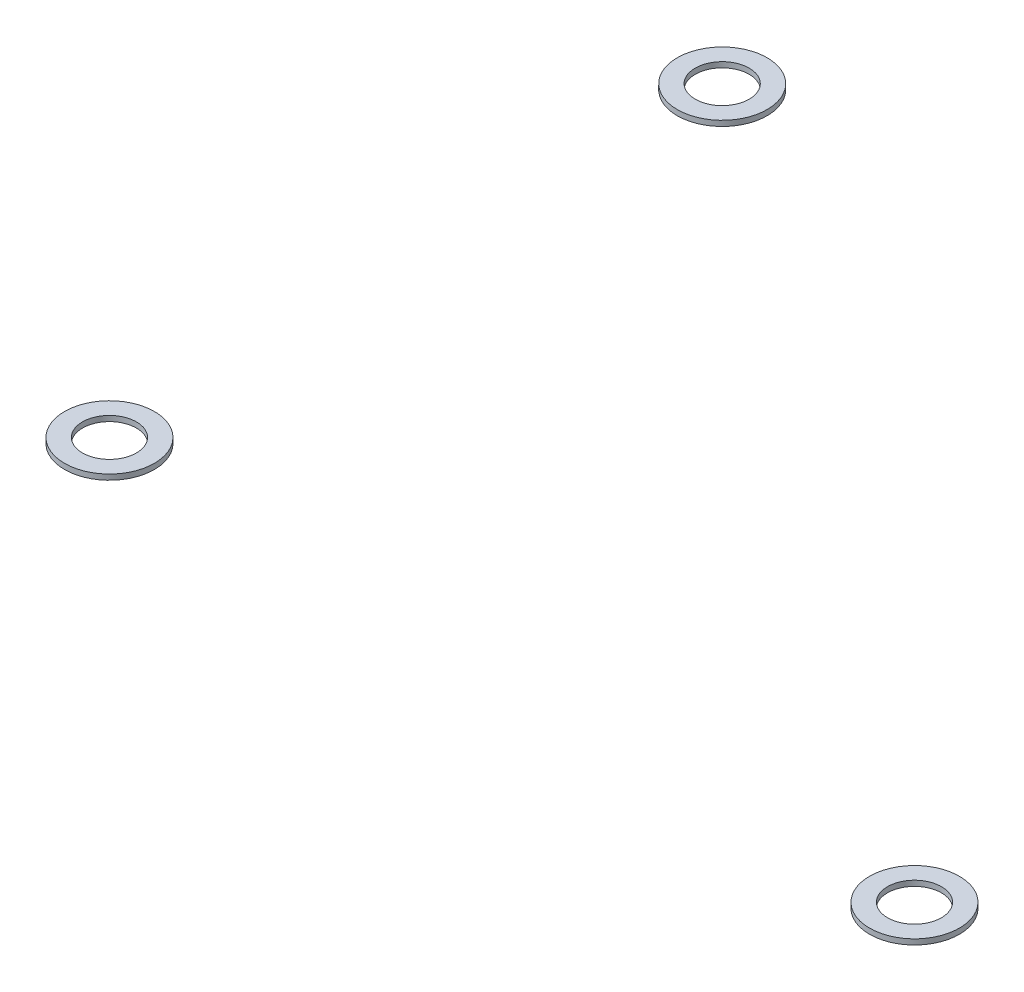
ISO-10303-21;
HEADER;
FILE_DESCRIPTION(('STEP AP214'),'2;1');
FILE_NAME('part.step','',(''),(''),'','','');
FILE_SCHEMA(('AUTOMOTIVE_DESIGN { 1 0 10303 214 1 1 1 1 }'));
ENDSEC;
DATA;
#1=APPLICATION_CONTEXT('core data for automotive mechanical design processes');
#2=APPLICATION_PROTOCOL_DEFINITION('international standard','automotive_design',2000,#1);
#3=PRODUCT_CONTEXT('',#1,'mechanical');
#4=PRODUCT('Part','Part','',(#3));
#5=PRODUCT_RELATED_PRODUCT_CATEGORY('part','',(#4));
#6=PRODUCT_DEFINITION_FORMATION('','',#4);
#7=PRODUCT_DEFINITION_CONTEXT('part definition',#1,'design');
#8=PRODUCT_DEFINITION('design','',#6,#7);
#9=PRODUCT_DEFINITION_SHAPE('','',#8);
#10=(LENGTH_UNIT() NAMED_UNIT(*) SI_UNIT(.MILLI.,.METRE.));
#11=(NAMED_UNIT(*) PLANE_ANGLE_UNIT() SI_UNIT($,.RADIAN.));
#12=(NAMED_UNIT(*) SI_UNIT($,.STERADIAN.) SOLID_ANGLE_UNIT());
#13=UNCERTAINTY_MEASURE_WITH_UNIT(LENGTH_MEASURE(1.E-05),#10,'distance_accuracy_value','');
#14=(GEOMETRIC_REPRESENTATION_CONTEXT(3) GLOBAL_UNCERTAINTY_ASSIGNED_CONTEXT((#13)) GLOBAL_UNIT_ASSIGNED_CONTEXT((#10,
#11,#12)) REPRESENTATION_CONTEXT('',''));
#15=CARTESIAN_POINT('',(0.,0.,0.));
#16=DIRECTION('',(0.,0.,1.));
#17=DIRECTION('',(1.,0.,0.));
#18=AXIS2_PLACEMENT_3D('',#15,#16,#17);
#19=CARTESIAN_POINT('',(22.4,0.3,17.05));
#20=DIRECTION('',(0.,1.,0.));
#21=DIRECTION('',(0.,0.,1.));
#22=AXIS2_PLACEMENT_3D('',#19,#20,#21);
#23=PLANE('',#22);
#24=CARTESIAN_POINT('',(22.4,0.3,17.05));
#25=DIRECTION('',(0.,1.,0.));
#26=DIRECTION('',(0.,0.,1.));
#27=AXIS2_PLACEMENT_3D('',#24,#25,#26);
#28=CIRCLE('',#27,2.5);
#29=CARTESIAN_POINT('',(22.4,0.3,19.55));
#30=VERTEX_POINT('',#29);
#31=EDGE_CURVE('E67',#30,#30,#28,.T.);
#32=ORIENTED_EDGE('',*,*,#31,.T.);
#33=EDGE_LOOP('',(#32));
#34=FACE_BOUND('',#33,.T.);
#35=CARTESIAN_POINT('',(22.4,0.3,17.05));
#36=DIRECTION('',(0.,1.,0.));
#37=DIRECTION('',(0.,0.,1.));
#38=AXIS2_PLACEMENT_3D('',#35,#36,#37);
#39=CIRCLE('',#38,1.5);
#40=CARTESIAN_POINT('',(22.4,0.3,18.55));
#41=VERTEX_POINT('',#40);
#42=EDGE_CURVE('E56',#41,#41,#39,.T.);
#43=ORIENTED_EDGE('',*,*,#42,.F.);
#44=EDGE_LOOP('',(#43));
#45=FACE_BOUND('',#44,.T.);
#46=ADVANCED_FACE('F52',(#34,#45),#23,.T.);
#47=CARTESIAN_POINT('',(22.4,0.,17.05));
#48=DIRECTION('',(0.,1.,0.));
#49=DIRECTION('',(0.,0.,1.));
#50=AXIS2_PLACEMENT_3D('',#47,#48,#49);
#51=PLANE('',#50);
#52=CARTESIAN_POINT('',(22.4,0.,17.05));
#53=DIRECTION('',(0.,1.,0.));
#54=DIRECTION('',(0.,0.,1.));
#55=AXIS2_PLACEMENT_3D('',#52,#53,#54);
#56=CIRCLE('',#55,2.5);
#57=CARTESIAN_POINT('',(22.4,0.,19.55));
#58=VERTEX_POINT('',#57);
#59=EDGE_CURVE('E65',#58,#58,#56,.T.);
#60=ORIENTED_EDGE('',*,*,#59,.F.);
#61=EDGE_LOOP('',(#60));
#62=FACE_BOUND('',#61,.T.);
#63=CARTESIAN_POINT('',(22.4,0.,17.05));
#64=DIRECTION('',(0.,1.,0.));
#65=DIRECTION('',(0.,0.,1.));
#66=AXIS2_PLACEMENT_3D('',#63,#64,#65);
#67=CIRCLE('',#66,1.5);
#68=CARTESIAN_POINT('',(22.4,0.,18.55));
#69=VERTEX_POINT('',#68);
#70=EDGE_CURVE('E11',#69,#69,#67,.T.);
#71=ORIENTED_EDGE('',*,*,#70,.T.);
#72=EDGE_LOOP('',(#71));
#73=FACE_BOUND('',#72,.T.);
#74=ADVANCED_FACE('F77',(#62,#73),#51,.F.);
#75=CARTESIAN_POINT('',(22.4,0.3,17.05));
#76=DIRECTION('',(0.,-1.,0.));
#77=DIRECTION('',(0.,0.,-1.));
#78=AXIS2_PLACEMENT_3D('',#75,#76,#77);
#79=CYLINDRICAL_SURFACE('',#78,2.5);
#80=ORIENTED_EDGE('',*,*,#31,.F.);
#81=EDGE_LOOP('',(#80));
#82=FACE_BOUND('',#81,.T.);
#83=ORIENTED_EDGE('',*,*,#59,.T.);
#84=EDGE_LOOP('',(#83));
#85=FACE_BOUND('',#84,.T.);
#86=ADVANCED_FACE('F75',(#82,#85),#79,.T.);
#87=CARTESIAN_POINT('',(22.4,0.3,17.05));
#88=DIRECTION('',(0.,-1.,0.));
#89=DIRECTION('',(0.,0.,-1.));
#90=AXIS2_PLACEMENT_3D('',#87,#88,#89);
#91=CYLINDRICAL_SURFACE('',#90,1.5);
#92=ORIENTED_EDGE('',*,*,#42,.T.);
#93=EDGE_LOOP('',(#92));
#94=FACE_BOUND('',#93,.T.);
#95=ORIENTED_EDGE('',*,*,#70,.F.);
#96=EDGE_LOOP('',(#95));
#97=FACE_BOUND('',#96,.T.);
#98=ADVANCED_FACE('F54',(#94,#97),#91,.F.);
#99=CLOSED_SHELL('',(#46,#74,#86,#98));
#100=MANIFOLD_SOLID_BREP('B2',#99);
#101=CARTESIAN_POINT('',(-22.4,0.3,17.05));
#102=DIRECTION('',(0.,1.,0.));
#103=DIRECTION('',(0.,0.,1.));
#104=AXIS2_PLACEMENT_3D('',#101,#102,#103);
#105=PLANE('',#104);
#106=CARTESIAN_POINT('',(-22.4,0.3,17.05));
#107=DIRECTION('',(0.,1.,0.));
#108=DIRECTION('',(0.,0.,1.));
#109=AXIS2_PLACEMENT_3D('',#106,#107,#108);
#110=CIRCLE('',#109,2.5);
#111=CARTESIAN_POINT('',(-22.4,0.3,19.55));
#112=VERTEX_POINT('',#111);
#113=EDGE_CURVE('E138',#112,#112,#110,.T.);
#114=ORIENTED_EDGE('',*,*,#113,.T.);
#115=EDGE_LOOP('',(#114));
#116=FACE_BOUND('',#115,.T.);
#117=CARTESIAN_POINT('',(-22.4,0.3,17.05));
#118=DIRECTION('',(0.,1.,0.));
#119=DIRECTION('',(0.,0.,1.));
#120=AXIS2_PLACEMENT_3D('',#117,#118,#119);
#121=CIRCLE('',#120,1.5);
#122=CARTESIAN_POINT('',(-22.4,0.3,18.55));
#123=VERTEX_POINT('',#122);
#124=EDGE_CURVE('E129',#123,#123,#121,.T.);
#125=ORIENTED_EDGE('',*,*,#124,.F.);
#126=EDGE_LOOP('',(#125));
#127=FACE_BOUND('',#126,.T.);
#128=ADVANCED_FACE('F125',(#116,#127),#105,.T.);
#129=CARTESIAN_POINT('',(-22.4,0.,17.05));
#130=DIRECTION('',(0.,1.,0.));
#131=DIRECTION('',(0.,0.,1.));
#132=AXIS2_PLACEMENT_3D('',#129,#130,#131);
#133=PLANE('',#132);
#134=CARTESIAN_POINT('',(-22.4,0.,17.05));
#135=DIRECTION('',(0.,1.,0.));
#136=DIRECTION('',(0.,0.,1.));
#137=AXIS2_PLACEMENT_3D('',#134,#135,#136);
#138=CIRCLE('',#137,2.5);
#139=CARTESIAN_POINT('',(-22.4,0.,19.55));
#140=VERTEX_POINT('',#139);
#141=EDGE_CURVE('E136',#140,#140,#138,.T.);
#142=ORIENTED_EDGE('',*,*,#141,.F.);
#143=EDGE_LOOP('',(#142));
#144=FACE_BOUND('',#143,.T.);
#145=CARTESIAN_POINT('',(-22.4,0.,17.05));
#146=DIRECTION('',(0.,1.,0.));
#147=DIRECTION('',(0.,0.,1.));
#148=AXIS2_PLACEMENT_3D('',#145,#146,#147);
#149=CIRCLE('',#148,1.5);
#150=CARTESIAN_POINT('',(-22.4,0.,18.55));
#151=VERTEX_POINT('',#150);
#152=EDGE_CURVE('E51',#151,#151,#149,.T.);
#153=ORIENTED_EDGE('',*,*,#152,.T.);
#154=EDGE_LOOP('',(#153));
#155=FACE_BOUND('',#154,.T.);
#156=ADVANCED_FACE('F146',(#144,#155),#133,.F.);
#157=CARTESIAN_POINT('',(-22.4,0.3,17.05));
#158=DIRECTION('',(0.,-1.,0.));
#159=DIRECTION('',(0.,0.,-1.));
#160=AXIS2_PLACEMENT_3D('',#157,#158,#159);
#161=CYLINDRICAL_SURFACE('',#160,2.5);
#162=ORIENTED_EDGE('',*,*,#113,.F.);
#163=EDGE_LOOP('',(#162));
#164=FACE_BOUND('',#163,.T.);
#165=ORIENTED_EDGE('',*,*,#141,.T.);
#166=EDGE_LOOP('',(#165));
#167=FACE_BOUND('',#166,.T.);
#168=ADVANCED_FACE('F144',(#164,#167),#161,.T.);
#169=CARTESIAN_POINT('',(-22.4,0.3,17.05));
#170=DIRECTION('',(0.,-1.,0.));
#171=DIRECTION('',(0.,0.,-1.));
#172=AXIS2_PLACEMENT_3D('',#169,#170,#171);
#173=CYLINDRICAL_SURFACE('',#172,1.5);
#174=ORIENTED_EDGE('',*,*,#124,.T.);
#175=EDGE_LOOP('',(#174));
#176=FACE_BOUND('',#175,.T.);
#177=ORIENTED_EDGE('',*,*,#152,.F.);
#178=EDGE_LOOP('',(#177));
#179=FACE_BOUND('',#178,.T.);
#180=ADVANCED_FACE('F127',(#176,#179),#173,.F.);
#181=CLOSED_SHELL('',(#128,#156,#168,#180));
#182=MANIFOLD_SOLID_BREP('B6',#181);
#183=CARTESIAN_POINT('',(-22.4,0.3,-17.05));
#184=DIRECTION('',(0.,1.,0.));
#185=DIRECTION('',(0.,0.,1.));
#186=AXIS2_PLACEMENT_3D('',#183,#184,#185);
#187=PLANE('',#186);
#188=CARTESIAN_POINT('',(-22.4,0.3,-17.05));
#189=DIRECTION('',(0.,1.,0.));
#190=DIRECTION('',(0.,0.,1.));
#191=AXIS2_PLACEMENT_3D('',#188,#189,#190);
#192=CIRCLE('',#191,2.5);
#193=CARTESIAN_POINT('',(-22.4,0.3,-14.55));
#194=VERTEX_POINT('',#193);
#195=EDGE_CURVE('E124',#194,#194,#192,.T.);
#196=ORIENTED_EDGE('',*,*,#195,.T.);
#197=EDGE_LOOP('',(#196));
#198=FACE_BOUND('',#197,.T.);
#199=CARTESIAN_POINT('',(-22.4,0.3,-17.05));
#200=DIRECTION('',(0.,1.,0.));
#201=DIRECTION('',(0.,0.,1.));
#202=AXIS2_PLACEMENT_3D('',#199,#200,#201);
#203=CIRCLE('',#202,1.5);
#204=CARTESIAN_POINT('',(-22.4,0.3,-15.55));
#205=VERTEX_POINT('',#204);
#206=EDGE_CURVE('E198',#205,#205,#203,.T.);
#207=ORIENTED_EDGE('',*,*,#206,.F.);
#208=EDGE_LOOP('',(#207));
#209=FACE_BOUND('',#208,.T.);
#210=ADVANCED_FACE('F187',(#198,#209),#187,.T.);
#211=CARTESIAN_POINT('',(-22.4,0.,-17.05));
#212=DIRECTION('',(0.,1.,0.));
#213=DIRECTION('',(0.,0.,1.));
#214=AXIS2_PLACEMENT_3D('',#211,#212,#213);
#215=PLANE('',#214);
#216=CARTESIAN_POINT('',(-22.4,0.,-17.05));
#217=DIRECTION('',(0.,1.,0.));
#218=DIRECTION('',(0.,0.,1.));
#219=AXIS2_PLACEMENT_3D('',#216,#217,#218);
#220=CIRCLE('',#219,2.5);
#221=CARTESIAN_POINT('',(-22.4,0.,-14.55));
#222=VERTEX_POINT('',#221);
#223=EDGE_CURVE('E191',#222,#222,#220,.T.);
#224=ORIENTED_EDGE('',*,*,#223,.F.);
#225=EDGE_LOOP('',(#224));
#226=FACE_BOUND('',#225,.T.);
#227=CARTESIAN_POINT('',(-22.4,0.,-17.05));
#228=DIRECTION('',(0.,1.,0.));
#229=DIRECTION('',(0.,0.,1.));
#230=AXIS2_PLACEMENT_3D('',#227,#228,#229);
#231=CIRCLE('',#230,1.5);
#232=CARTESIAN_POINT('',(-22.4,0.,-15.55));
#233=VERTEX_POINT('',#232);
#234=EDGE_CURVE('E200',#233,#233,#231,.T.);
#235=ORIENTED_EDGE('',*,*,#234,.T.);
#236=EDGE_LOOP('',(#235));
#237=FACE_BOUND('',#236,.T.);
#238=ADVANCED_FACE('F210',(#226,#237),#215,.F.);
#239=CARTESIAN_POINT('',(-22.4,0.3,-17.05));
#240=DIRECTION('',(0.,-1.,0.));
#241=DIRECTION('',(0.,0.,-1.));
#242=AXIS2_PLACEMENT_3D('',#239,#240,#241);
#243=CYLINDRICAL_SURFACE('',#242,2.5);
#244=ORIENTED_EDGE('',*,*,#195,.F.);
#245=EDGE_LOOP('',(#244));
#246=FACE_BOUND('',#245,.T.);
#247=ORIENTED_EDGE('',*,*,#223,.T.);
#248=EDGE_LOOP('',(#247));
#249=FACE_BOUND('',#248,.T.);
#250=ADVANCED_FACE('F189',(#246,#249),#243,.T.);
#251=CARTESIAN_POINT('',(-22.4,0.3,-17.05));
#252=DIRECTION('',(0.,-1.,0.));
#253=DIRECTION('',(0.,0.,-1.));
#254=AXIS2_PLACEMENT_3D('',#251,#252,#253);
#255=CYLINDRICAL_SURFACE('',#254,1.5);
#256=ORIENTED_EDGE('',*,*,#206,.T.);
#257=EDGE_LOOP('',(#256));
#258=FACE_BOUND('',#257,.T.);
#259=ORIENTED_EDGE('',*,*,#234,.F.);
#260=EDGE_LOOP('',(#259));
#261=FACE_BOUND('',#260,.T.);
#262=ADVANCED_FACE('F206',(#258,#261),#255,.F.);
#263=CLOSED_SHELL('',(#210,#238,#250,#262));
#264=MANIFOLD_SOLID_BREP('B46',#263);
#265=ADVANCED_BREP_SHAPE_REPRESENTATION('',(#18,#100,#182,#264),#14);
#266=SHAPE_DEFINITION_REPRESENTATION(#9,#265);
ENDSEC;
END-ISO-10303-21;
